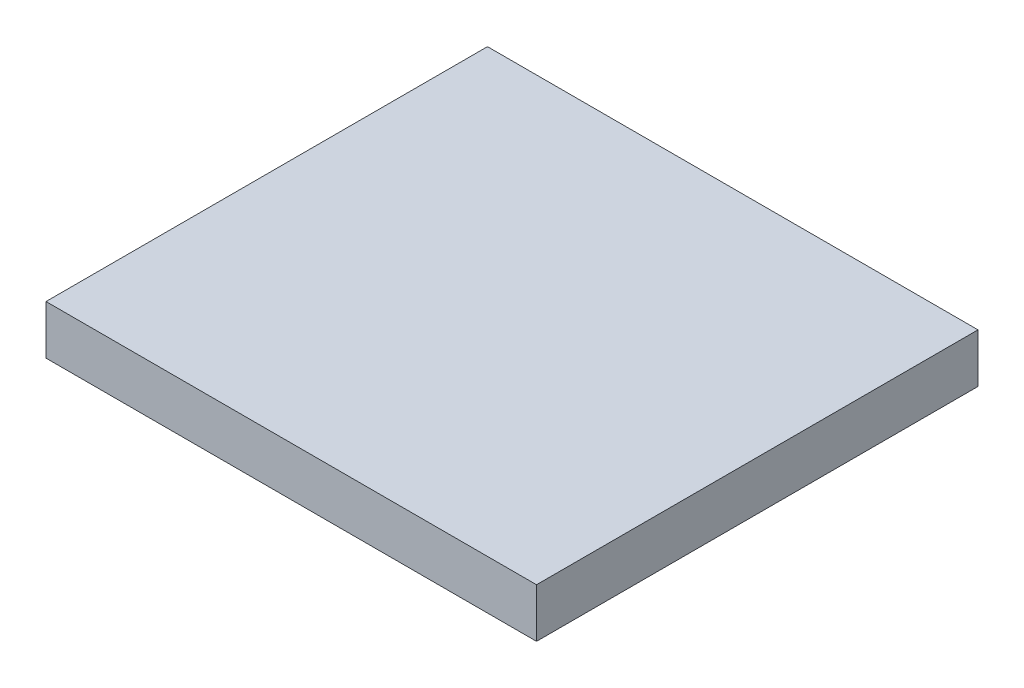
ISO-10303-21;
HEADER;
FILE_DESCRIPTION(('STEP AP214'),'2;1');
FILE_NAME('part.step','',(''),(''),'','','');
FILE_SCHEMA(('AUTOMOTIVE_DESIGN { 1 0 10303 214 1 1 1 1 }'));
ENDSEC;
DATA;
#1=APPLICATION_CONTEXT('core data for automotive mechanical design processes');
#2=APPLICATION_PROTOCOL_DEFINITION('international standard','automotive_design',2000,#1);
#3=PRODUCT_CONTEXT('',#1,'mechanical');
#4=PRODUCT('Part','Part','',(#3));
#5=PRODUCT_RELATED_PRODUCT_CATEGORY('part','',(#4));
#6=PRODUCT_DEFINITION_FORMATION('','',#4);
#7=PRODUCT_DEFINITION_CONTEXT('part definition',#1,'design');
#8=PRODUCT_DEFINITION('design','',#6,#7);
#9=PRODUCT_DEFINITION_SHAPE('','',#8);
#10=(LENGTH_UNIT() NAMED_UNIT(*) SI_UNIT(.MILLI.,.METRE.));
#11=(NAMED_UNIT(*) PLANE_ANGLE_UNIT() SI_UNIT($,.RADIAN.));
#12=(NAMED_UNIT(*) SI_UNIT($,.STERADIAN.) SOLID_ANGLE_UNIT());
#13=UNCERTAINTY_MEASURE_WITH_UNIT(LENGTH_MEASURE(1.E-05),#10,'distance_accuracy_value','');
#14=(GEOMETRIC_REPRESENTATION_CONTEXT(3) GLOBAL_UNCERTAINTY_ASSIGNED_CONTEXT((#13)) GLOBAL_UNIT_ASSIGNED_CONTEXT((#10,
#11,#12)) REPRESENTATION_CONTEXT('',''));
#15=CARTESIAN_POINT('',(0.,0.,0.));
#16=DIRECTION('',(0.,0.,1.));
#17=DIRECTION('',(1.,0.,0.));
#18=AXIS2_PLACEMENT_3D('',#15,#16,#17);
#19=CARTESIAN_POINT('',(-254.,50.8,228.6));
#20=DIRECTION('',(1.,0.,0.));
#21=DIRECTION('',(0.,0.,-1.));
#22=AXIS2_PLACEMENT_3D('',#19,#20,#21);
#23=PLANE('',#22);
#24=DIRECTION('',(0.,0.,1.));
#25=VECTOR('',#24,1.);
#26=CARTESIAN_POINT('',(-254.,0.,228.6));
#27=LINE('',#26,#25);
#28=CARTESIAN_POINT('',(-254.,0.,-228.6));
#29=VERTEX_POINT('',#28);
#30=CARTESIAN_POINT('',(-254.,0.,228.6));
#31=VERTEX_POINT('',#30);
#32=EDGE_CURVE('E95',#29,#31,#27,.T.);
#33=ORIENTED_EDGE('',*,*,#32,.T.);
#34=DIRECTION('',(0.,-1.,0.));
#35=VECTOR('',#34,1.);
#36=CARTESIAN_POINT('',(-254.,50.8,228.6));
#37=LINE('',#36,#35);
#38=CARTESIAN_POINT('',(-254.,50.8,228.6));
#39=VERTEX_POINT('',#38);
#40=EDGE_CURVE('E11',#39,#31,#37,.T.);
#41=ORIENTED_EDGE('',*,*,#40,.F.);
#42=DIRECTION('',(0.,0.,1.));
#43=VECTOR('',#42,1.);
#44=CARTESIAN_POINT('',(-254.,50.8,228.6));
#45=LINE('',#44,#43);
#46=CARTESIAN_POINT('',(-254.,50.8,-228.6));
#47=VERTEX_POINT('',#46);
#48=EDGE_CURVE('E83',#47,#39,#45,.T.);
#49=ORIENTED_EDGE('',*,*,#48,.F.);
#50=DIRECTION('',(0.,-1.,0.));
#51=VECTOR('',#50,1.);
#52=CARTESIAN_POINT('',(-254.,50.8,-228.6));
#53=LINE('',#52,#51);
#54=EDGE_CURVE('E91',#47,#29,#53,.T.);
#55=ORIENTED_EDGE('',*,*,#54,.T.);
#56=EDGE_LOOP('',(#33,#41,#49,#55));
#57=FACE_BOUND('',#56,.T.);
#58=ADVANCED_FACE('F32',(#57),#23,.F.);
#59=CARTESIAN_POINT('',(254.,50.8,228.6));
#60=DIRECTION('',(0.,0.,-1.));
#61=DIRECTION('',(-1.,0.,0.));
#62=AXIS2_PLACEMENT_3D('',#59,#60,#61);
#63=PLANE('',#62);
#64=DIRECTION('',(1.,0.,0.));
#65=VECTOR('',#64,1.);
#66=CARTESIAN_POINT('',(254.,0.,228.6));
#67=LINE('',#66,#65);
#68=CARTESIAN_POINT('',(254.,0.,228.6));
#69=VERTEX_POINT('',#68);
#70=EDGE_CURVE('E87',#31,#69,#67,.T.);
#71=ORIENTED_EDGE('',*,*,#70,.T.);
#72=DIRECTION('',(0.,-1.,0.));
#73=VECTOR('',#72,1.);
#74=CARTESIAN_POINT('',(254.,50.8,228.6));
#75=LINE('',#74,#73);
#76=CARTESIAN_POINT('',(254.,50.8,228.6));
#77=VERTEX_POINT('',#76);
#78=EDGE_CURVE('E40',#77,#69,#75,.T.);
#79=ORIENTED_EDGE('',*,*,#78,.F.);
#80=DIRECTION('',(1.,0.,0.));
#81=VECTOR('',#80,1.);
#82=CARTESIAN_POINT('',(254.,50.8,228.6));
#83=LINE('',#82,#81);
#84=EDGE_CURVE('E78',#39,#77,#83,.T.);
#85=ORIENTED_EDGE('',*,*,#84,.F.);
#86=ORIENTED_EDGE('',*,*,#40,.T.);
#87=EDGE_LOOP('',(#71,#79,#85,#86));
#88=FACE_BOUND('',#87,.T.);
#89=ADVANCED_FACE('F86',(#88),#63,.F.);
#90=CARTESIAN_POINT('',(254.,50.8,228.6));
#91=DIRECTION('',(-1.,0.,0.));
#92=DIRECTION('',(0.,0.,1.));
#93=AXIS2_PLACEMENT_3D('',#90,#91,#92);
#94=PLANE('',#93);
#95=DIRECTION('',(0.,0.,-1.));
#96=VECTOR('',#95,1.);
#97=CARTESIAN_POINT('',(254.,0.,228.6));
#98=LINE('',#97,#96);
#99=CARTESIAN_POINT('',(254.,0.,-228.6));
#100=VERTEX_POINT('',#99);
#101=EDGE_CURVE('E65',#69,#100,#98,.T.);
#102=ORIENTED_EDGE('',*,*,#101,.T.);
#103=DIRECTION('',(0.,-1.,0.));
#104=VECTOR('',#103,1.);
#105=CARTESIAN_POINT('',(254.,50.8,-228.6));
#106=LINE('',#105,#104);
#107=CARTESIAN_POINT('',(254.,50.8,-228.6));
#108=VERTEX_POINT('',#107);
#109=EDGE_CURVE('E88',#108,#100,#106,.T.);
#110=ORIENTED_EDGE('',*,*,#109,.F.);
#111=DIRECTION('',(0.,0.,-1.));
#112=VECTOR('',#111,1.);
#113=CARTESIAN_POINT('',(254.,50.8,228.6));
#114=LINE('',#113,#112);
#115=EDGE_CURVE('E81',#77,#108,#114,.T.);
#116=ORIENTED_EDGE('',*,*,#115,.F.);
#117=ORIENTED_EDGE('',*,*,#78,.T.);
#118=EDGE_LOOP('',(#102,#110,#116,#117));
#119=FACE_BOUND('',#118,.T.);
#120=ADVANCED_FACE('F89',(#119),#94,.F.);
#121=CARTESIAN_POINT('',(254.,50.8,-228.6));
#122=DIRECTION('',(0.,0.,1.));
#123=DIRECTION('',(1.,0.,0.));
#124=AXIS2_PLACEMENT_3D('',#121,#122,#123);
#125=PLANE('',#124);
#126=DIRECTION('',(-1.,0.,0.));
#127=VECTOR('',#126,1.);
#128=CARTESIAN_POINT('',(254.,0.,-228.6));
#129=LINE('',#128,#127);
#130=EDGE_CURVE('E71',#100,#29,#129,.T.);
#131=ORIENTED_EDGE('',*,*,#130,.T.);
#132=ORIENTED_EDGE('',*,*,#54,.F.);
#133=DIRECTION('',(-1.,0.,0.));
#134=VECTOR('',#133,1.);
#135=CARTESIAN_POINT('',(254.,50.8,-228.6));
#136=LINE('',#135,#134);
#137=EDGE_CURVE('E48',#108,#47,#136,.T.);
#138=ORIENTED_EDGE('',*,*,#137,.F.);
#139=ORIENTED_EDGE('',*,*,#109,.T.);
#140=EDGE_LOOP('',(#131,#132,#138,#139));
#141=FACE_BOUND('',#140,.T.);
#142=ADVANCED_FACE('F102',(#141),#125,.F.);
#143=CARTESIAN_POINT('',(0.,50.8,0.));
#144=DIRECTION('',(0.,1.,0.));
#145=DIRECTION('',(0.,0.,1.));
#146=AXIS2_PLACEMENT_3D('',#143,#144,#145);
#147=PLANE('',#146);
#148=ORIENTED_EDGE('',*,*,#48,.T.);
#149=ORIENTED_EDGE('',*,*,#84,.T.);
#150=ORIENTED_EDGE('',*,*,#115,.T.);
#151=ORIENTED_EDGE('',*,*,#137,.T.);
#152=EDGE_LOOP('',(#148,#149,#150,#151));
#153=FACE_BOUND('',#152,.T.);
#154=ADVANCED_FACE('F79',(#153),#147,.T.);
#155=CARTESIAN_POINT('',(0.,0.,0.));
#156=DIRECTION('',(0.,1.,0.));
#157=DIRECTION('',(0.,0.,1.));
#158=AXIS2_PLACEMENT_3D('',#155,#156,#157);
#159=PLANE('',#158);
#160=ORIENTED_EDGE('',*,*,#32,.F.);
#161=ORIENTED_EDGE('',*,*,#130,.F.);
#162=ORIENTED_EDGE('',*,*,#101,.F.);
#163=ORIENTED_EDGE('',*,*,#70,.F.);
#164=EDGE_LOOP('',(#160,#161,#162,#163));
#165=FACE_BOUND('',#164,.T.);
#166=ADVANCED_FACE('F105',(#165),#159,.F.);
#167=CLOSED_SHELL('',(#58,#89,#120,#142,#154,#166));
#168=MANIFOLD_SOLID_BREP('B2',#167);
#169=ADVANCED_BREP_SHAPE_REPRESENTATION('',(#18,#168),#14);
#170=SHAPE_DEFINITION_REPRESENTATION(#9,#169);
ENDSEC;
END-ISO-10303-21;
